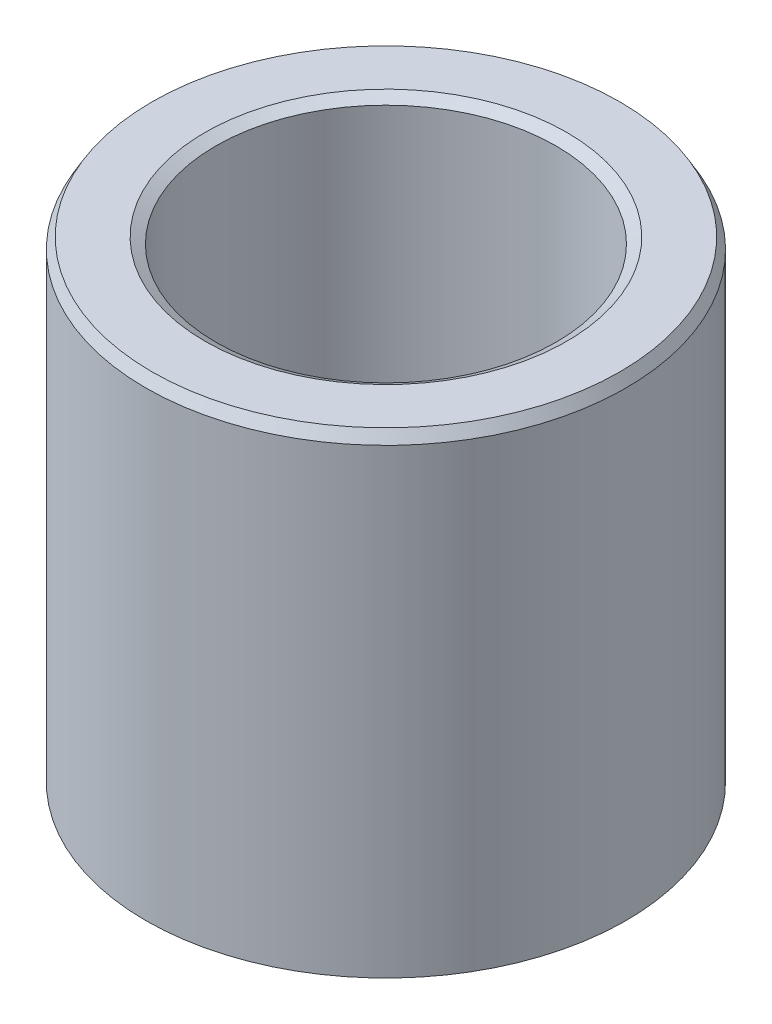
ISO-10303-21;
HEADER;
FILE_DESCRIPTION(('STEP AP214'),'2;1');
FILE_NAME('part.step','',(''),(''),'','','');
FILE_SCHEMA(('AUTOMOTIVE_DESIGN { 1 0 10303 214 1 1 1 1 }'));
ENDSEC;
DATA;
#1=APPLICATION_CONTEXT('core data for automotive mechanical design processes');
#2=APPLICATION_PROTOCOL_DEFINITION('international standard','automotive_design',2000,#1);
#3=PRODUCT_CONTEXT('',#1,'mechanical');
#4=PRODUCT('Part','Part','',(#3));
#5=PRODUCT_RELATED_PRODUCT_CATEGORY('part','',(#4));
#6=PRODUCT_DEFINITION_FORMATION('','',#4);
#7=PRODUCT_DEFINITION_CONTEXT('part definition',#1,'design');
#8=PRODUCT_DEFINITION('design','',#6,#7);
#9=PRODUCT_DEFINITION_SHAPE('','',#8);
#10=(LENGTH_UNIT() NAMED_UNIT(*) SI_UNIT(.MILLI.,.METRE.));
#11=(NAMED_UNIT(*) PLANE_ANGLE_UNIT() SI_UNIT($,.RADIAN.));
#12=(NAMED_UNIT(*) SI_UNIT($,.STERADIAN.) SOLID_ANGLE_UNIT());
#13=UNCERTAINTY_MEASURE_WITH_UNIT(LENGTH_MEASURE(1.E-05),#10,'distance_accuracy_value','');
#14=(GEOMETRIC_REPRESENTATION_CONTEXT(3) GLOBAL_UNCERTAINTY_ASSIGNED_CONTEXT((#13)) GLOBAL_UNIT_ASSIGNED_CONTEXT((#10,
#11,#12)) REPRESENTATION_CONTEXT('',''));
#15=CARTESIAN_POINT('',(0.,0.,0.));
#16=DIRECTION('',(0.,0.,1.));
#17=DIRECTION('',(1.,0.,0.));
#18=AXIS2_PLACEMENT_3D('',#15,#16,#17);
#19=CARTESIAN_POINT('',(0.,54.7817527203341,0.));
#20=DIRECTION('',(0.,-1.,0.));
#21=DIRECTION('',(0.,0.,-1.));
#22=AXIS2_PLACEMENT_3D('',#19,#20,#21);
#23=CYLINDRICAL_SURFACE('',#22,27.5);
#24=CARTESIAN_POINT('',(0.,0.715190612894365,0.));
#25=DIRECTION('',(0.,1.,0.));
#26=DIRECTION('',(0.,0.,1.));
#27=AXIS2_PLACEMENT_3D('',#24,#25,#26);
#28=CIRCLE('',#27,27.5);
#29=CARTESIAN_POINT('',(0.,0.715190612894365,27.5));
#30=VERTEX_POINT('',#29);
#31=EDGE_CURVE('E10',#30,#30,#28,.T.);
#32=ORIENTED_EDGE('',*,*,#31,.T.);
#33=EDGE_LOOP('',(#32));
#34=FACE_BOUND('',#33,.T.);
#35=CARTESIAN_POINT('',(0.,53.5430062417047,0.));
#36=DIRECTION('',(0.,1.,0.));
#37=DIRECTION('',(0.,0.,1.));
#38=AXIS2_PLACEMENT_3D('',#35,#36,#37);
#39=CIRCLE('',#38,27.5);
#40=CARTESIAN_POINT('',(0.,53.5430062417047,27.5));
#41=VERTEX_POINT('',#40);
#42=EDGE_CURVE('E50',#41,#41,#39,.F.);
#43=ORIENTED_EDGE('',*,*,#42,.T.);
#44=EDGE_LOOP('',(#43));
#45=FACE_BOUND('',#44,.T.);
#46=ADVANCED_FACE('F39',(#34,#45),#23,.T.);
#47=CARTESIAN_POINT('',(0.,54.7817527203341,0.));
#48=DIRECTION('',(0.,1.,0.));
#49=DIRECTION('',(0.,0.,1.));
#50=AXIS2_PLACEMENT_3D('',#47,#48,#49);
#51=PLANE('',#50);
#52=CARTESIAN_POINT('',(0.,54.7817527203341,0.));
#53=DIRECTION('',(0.,1.,0.));
#54=DIRECTION('',(0.,0.,1.));
#55=AXIS2_PLACEMENT_3D('',#52,#53,#54);
#56=CIRCLE('',#55,20.7174932138339);
#57=CARTESIAN_POINT('',(0.,54.7817527203341,20.7174932138339));
#58=VERTEX_POINT('',#57);
#59=EDGE_CURVE('E58',#58,#58,#56,.F.);
#60=ORIENTED_EDGE('',*,*,#59,.T.);
#61=EDGE_LOOP('',(#60));
#62=FACE_BOUND('',#61,.T.);
#63=CARTESIAN_POINT('',(0.,54.7817527203341,0.));
#64=DIRECTION('',(0.,1.,0.));
#65=DIRECTION('',(0.,0.,1.));
#66=AXIS2_PLACEMENT_3D('',#63,#64,#65);
#67=CIRCLE('',#66,26.7848093871057);
#68=CARTESIAN_POINT('',(0.,54.7817527203341,26.7848093871057));
#69=VERTEX_POINT('',#68);
#70=EDGE_CURVE('E61',#69,#69,#67,.T.);
#71=ORIENTED_EDGE('',*,*,#70,.T.);
#72=EDGE_LOOP('',(#71));
#73=FACE_BOUND('',#72,.T.);
#74=ADVANCED_FACE('F88',(#62,#73),#51,.T.);
#75=CARTESIAN_POINT('',(0.,0.,0.));
#76=DIRECTION('',(0.,1.,0.));
#77=DIRECTION('',(0.,0.,1.));
#78=AXIS2_PLACEMENT_3D('',#75,#76,#77);
#79=PLANE('',#78);
#80=CARTESIAN_POINT('',(0.,0.,0.));
#81=DIRECTION('',(0.,1.,0.));
#82=DIRECTION('',(0.,0.,1.));
#83=AXIS2_PLACEMENT_3D('',#80,#81,#82);
#84=CIRCLE('',#83,20.1939373480989);
#85=CARTESIAN_POINT('',(0.,0.,20.1939373480989));
#86=VERTEX_POINT('',#85);
#87=EDGE_CURVE('E51',#86,#86,#84,.T.);
#88=ORIENTED_EDGE('',*,*,#87,.T.);
#89=EDGE_LOOP('',(#88));
#90=FACE_BOUND('',#89,.T.);
#91=CARTESIAN_POINT('',(0.,0.,0.));
#92=DIRECTION('',(0.,1.,0.));
#93=DIRECTION('',(0.,0.,1.));
#94=AXIS2_PLACEMENT_3D('',#91,#92,#93);
#95=CIRCLE('',#94,26.2612535213706);
#96=CARTESIAN_POINT('',(0.,0.,26.2612535213706));
#97=VERTEX_POINT('',#96);
#98=EDGE_CURVE('E54',#97,#97,#95,.F.);
#99=ORIENTED_EDGE('',*,*,#98,.T.);
#100=EDGE_LOOP('',(#99));
#101=FACE_BOUND('',#100,.T.);
#102=ADVANCED_FACE('F83',(#90,#101),#79,.F.);
#103=CARTESIAN_POINT('',(0.,54.7817527203341,0.));
#104=DIRECTION('',(0.,-1.,0.));
#105=DIRECTION('',(0.,0.,-1.));
#106=AXIS2_PLACEMENT_3D('',#103,#104,#105);
#107=CYLINDRICAL_SURFACE('',#106,19.4787467352045);
#108=CARTESIAN_POINT('',(0.,54.0665621074397,0.));
#109=DIRECTION('',(0.,1.,0.));
#110=DIRECTION('',(0.,0.,1.));
#111=AXIS2_PLACEMENT_3D('',#108,#109,#110);
#112=CIRCLE('',#111,19.4787467352045);
#113=CARTESIAN_POINT('',(0.,54.0665621074397,19.4787467352045));
#114=VERTEX_POINT('',#113);
#115=EDGE_CURVE('E67',#114,#114,#112,.T.);
#116=ORIENTED_EDGE('',*,*,#115,.T.);
#117=EDGE_LOOP('',(#116));
#118=FACE_BOUND('',#117,.T.);
#119=CARTESIAN_POINT('',(0.,1.23874647862936,0.));
#120=DIRECTION('',(0.,1.,0.));
#121=DIRECTION('',(0.,0.,1.));
#122=AXIS2_PLACEMENT_3D('',#119,#120,#121);
#123=CIRCLE('',#122,19.4787467352045);
#124=CARTESIAN_POINT('',(0.,1.23874647862936,19.4787467352045));
#125=VERTEX_POINT('',#124);
#126=EDGE_CURVE('E69',#125,#125,#123,.F.);
#127=ORIENTED_EDGE('',*,*,#126,.T.);
#128=EDGE_LOOP('',(#127));
#129=FACE_BOUND('',#128,.T.);
#130=ADVANCED_FACE('F71',(#118,#129),#107,.F.);
#131=CARTESIAN_POINT('',(0.,54.0665621074397,0.));
#132=DIRECTION('',(0.,1.,0.));
#133=DIRECTION('',(0.,0.,1.));
#134=AXIS2_PLACEMENT_3D('',#131,#132,#133);
#135=CONICAL_SURFACE('',#134,19.4787467352045,1.0471975511966);
#136=CARTESIAN_POINT('',(0.,54.7817527203341,20.7174932138339));
#137=CARTESIAN_POINT('',(0.,54.7743028181164,20.7045896046815));
#138=CARTESIAN_POINT('',(0.,54.7668529158988,20.6916859955292));
#139=CARTESIAN_POINT('',(0.,54.7519531114635,20.6658787772244));
#140=CARTESIAN_POINT('',(0.,54.7445032092458,20.652975168072));
#141=CARTESIAN_POINT('',(0.,54.7296034048105,20.6271679497672));
#142=CARTESIAN_POINT('',(0.,54.7221535025929,20.6142643406148));
#143=CARTESIAN_POINT('',(0.,54.7072536981576,20.58845712231));
#144=CARTESIAN_POINT('',(0.,54.6998037959399,20.5755535131577));
#145=CARTESIAN_POINT('',(0.,54.6849039915046,20.5497462948529));
#146=CARTESIAN_POINT('',(0.,54.677454089287,20.5368426857005));
#147=CARTESIAN_POINT('',(0.,54.6625542848517,20.5110354673957));
#148=CARTESIAN_POINT('',(0.,54.655104382634,20.4981318582433));
#149=CARTESIAN_POINT('',(0.,54.6402045781987,20.4723246399385));
#150=CARTESIAN_POINT('',(0.,54.6327546759811,20.4594210307861));
#151=CARTESIAN_POINT('',(0.,54.6178548715458,20.4336138124814));
#152=CARTESIAN_POINT('',(0.,54.6104049693281,20.420710203329));
#153=CARTESIAN_POINT('',(0.,54.5955051648928,20.3949029850242));
#154=CARTESIAN_POINT('',(0.,54.5880552626752,20.3819993758718));
#155=CARTESIAN_POINT('',(0.,54.5731554582399,20.356192157567));
#156=CARTESIAN_POINT('',(0.,54.5657055560222,20.3432885484146));
#157=CARTESIAN_POINT('',(0.,54.5508057515869,20.3174813301099));
#158=CARTESIAN_POINT('',(0.,54.5433558493693,20.3045777209575));
#159=CARTESIAN_POINT('',(0.,54.528456044934,20.2787705026527));
#160=CARTESIAN_POINT('',(0.,54.5210061427163,20.2658668935003));
#161=CARTESIAN_POINT('',(0.,54.506106338281,20.2400596751955));
#162=CARTESIAN_POINT('',(0.,54.4986564360634,20.2271560660431));
#163=CARTESIAN_POINT('',(0.,54.4837566316281,20.2013488477384));
#164=CARTESIAN_POINT('',(0.,54.4763067294104,20.188445238586));
#165=CARTESIAN_POINT('',(0.,54.4614069249751,20.1626380202812));
#166=CARTESIAN_POINT('',(0.,54.4539570227575,20.1497344111288));
#167=CARTESIAN_POINT('',(0.,54.4390572183222,20.123927192824));
#168=CARTESIAN_POINT('',(0.,54.4316073161045,20.1110235836716));
#169=CARTESIAN_POINT('',(0.,54.4167075116692,20.0852163653668));
#170=CARTESIAN_POINT('',(0.,54.4092576094516,20.0723127562145));
#171=CARTESIAN_POINT('',(0.,54.3943578050163,20.0465055379097));
#172=CARTESIAN_POINT('',(0.,54.3869079027986,20.0336019287573));
#173=CARTESIAN_POINT('',(0.,54.3720080983633,20.0077947104525));
#174=CARTESIAN_POINT('',(0.,54.3645581961457,19.9948911013001));
#175=CARTESIAN_POINT('',(0.,54.3496583917104,19.9690838829953));
#176=CARTESIAN_POINT('',(0.,54.3422084894927,19.956180273843));
#177=CARTESIAN_POINT('',(0.,54.3273086850574,19.9303730555382));
#178=CARTESIAN_POINT('',(0.,54.3198587828398,19.9174694463858));
#179=CARTESIAN_POINT('',(0.,54.3049589784045,19.891662228081));
#180=CARTESIAN_POINT('',(0.,54.2975090761868,19.8787586189286));
#181=CARTESIAN_POINT('',(0.,54.2826092717515,19.8529514006238));
#182=CARTESIAN_POINT('',(0.,54.2751593695339,19.8400477914714));
#183=CARTESIAN_POINT('',(0.,54.2602595650986,19.8142405731667));
#184=CARTESIAN_POINT('',(0.,54.2528096628809,19.8013369640143));
#185=CARTESIAN_POINT('',(0.,54.2379098584456,19.7755297457095));
#186=CARTESIAN_POINT('',(0.,54.230459956228,19.7626261365571));
#187=CARTESIAN_POINT('',(0.,54.2155601517927,19.7368189182523));
#188=CARTESIAN_POINT('',(0.,54.208110249575,19.7239153090999));
#189=CARTESIAN_POINT('',(0.,54.1932104451397,19.6981080907952));
#190=CARTESIAN_POINT('',(0.,54.1857605429221,19.6852044816428));
#191=CARTESIAN_POINT('',(0.,54.1708607384868,19.659397263338));
#192=CARTESIAN_POINT('',(0.,54.1634108362691,19.6464936541856));
#193=CARTESIAN_POINT('',(0.,54.1485110318338,19.6206864358808));
#194=CARTESIAN_POINT('',(0.,54.1410611296162,19.6077828267284));
#195=CARTESIAN_POINT('',(0.,54.1261613251809,19.5819756084237));
#196=CARTESIAN_POINT('',(0.,54.1187114229632,19.5690719992713));
#197=CARTESIAN_POINT('',(0.,54.1038116185279,19.5432647809665));
#198=CARTESIAN_POINT('',(0.,54.0963617163103,19.5303611718141));
#199=CARTESIAN_POINT('',(0.,54.081461911875,19.5045539535093));
#200=CARTESIAN_POINT('',(0.,54.0740120096573,19.4916503443569));
#201=CARTESIAN_POINT('',(0.,54.0665621074397,19.4787467352045));
#202=B_SPLINE_CURVE_WITH_KNOTS('',3,(#136,#137,#138,#139,#140,#141,#142,#143,#144,#145,#146,
#147,#148,#149,#150,#151,#152,#153,#154,#155,#156,#157,#158,#159,#160,#161,#162,#163,#164,#165,
#166,#167,#168,#169,#170,#171,#172,#173,#174,#175,#176,#177,#178,#179,#180,#181,#182,#183,#184,
#185,#186,#187,#188,#189,#190,#191,#192,#193,#194,#195,#196,#197,#198,#199,#200,#201),
.UNSPECIFIED.,.F.,.F.,(4,2,2,2,2,2,2,2,2,2,2,2,2,2,2,2,2,2,2,2,2,2,2,2,2,2,2,2,2,2,2,2,4),(0.,
0.0446994133058967,0.0893988266117964,0.134098239917696,0.178797653223593,0.223497066529492,
0.268196479835392,0.312895893141292,0.357595306447189,0.402294719753088,0.446994133058988,
0.491693546364888,0.536392959670784,0.581092372976684,0.625791786282584,0.670491199588481,
0.71519061289438,0.75989002620028,0.80458943950618,0.849288852812077,0.893988266117976,
0.938687679423876,0.983387092729776,1.02808650603567,1.07278591934157,1.11748533264747,
1.16218474595337,1.20688415925927,1.25158357256517,1.29628298587107,1.34098239917696,
1.38568181248286,1.43038122578876),.UNSPECIFIED.);
#203=EDGE_CURVE('BSEAM77',#58,#114,#202,.T.);
#204=ORIENTED_EDGE('',*,*,#59,.F.);
#205=ORIENTED_EDGE('',*,*,#115,.F.);
#206=ORIENTED_EDGE('',*,*,#203,.T.);
#207=ORIENTED_EDGE('',*,*,#203,.F.);
#208=EDGE_LOOP('',(#204,#206,#205,#207));
#209=FACE_BOUND('',#208,.T.);
#210=ADVANCED_FACE('F77',(#209),#135,.F.);
#211=CARTESIAN_POINT('',(0.,0.,0.));
#212=DIRECTION('',(0.,-1.,0.));
#213=DIRECTION('',(0.,0.,-1.));
#214=AXIS2_PLACEMENT_3D('',#211,#212,#213);
#215=CONICAL_SURFACE('',#214,20.1939373480989,0.523598775598295);
#216=ORIENTED_EDGE('',*,*,#126,.F.);
#217=EDGE_LOOP('',(#216));
#218=FACE_BOUND('',#217,.T.);
#219=ORIENTED_EDGE('',*,*,#87,.F.);
#220=EDGE_LOOP('',(#219));
#221=FACE_BOUND('',#220,.T.);
#222=ADVANCED_FACE('F73',(#218,#221),#215,.F.);
#223=CARTESIAN_POINT('',(0.,0.715190612894365,0.));
#224=DIRECTION('',(0.,1.,0.));
#225=DIRECTION('',(0.,0.,1.));
#226=AXIS2_PLACEMENT_3D('',#223,#224,#225);
#227=CONICAL_SURFACE('',#226,27.5,1.0471975511966);
#228=ORIENTED_EDGE('',*,*,#98,.F.);
#229=EDGE_LOOP('',(#228));
#230=FACE_BOUND('',#229,.T.);
#231=ORIENTED_EDGE('',*,*,#31,.F.);
#232=EDGE_LOOP('',(#231));
#233=FACE_BOUND('',#232,.T.);
#234=ADVANCED_FACE('F76',(#230,#233),#227,.T.);
#235=CARTESIAN_POINT('',(0.,54.7817527203341,0.));
#236=DIRECTION('',(0.,-1.,0.));
#237=DIRECTION('',(0.,0.,-1.));
#238=AXIS2_PLACEMENT_3D('',#235,#236,#237);
#239=CONICAL_SURFACE('',#238,26.7848093871057,0.523598775598293);
#240=ORIENTED_EDGE('',*,*,#42,.F.);
#241=EDGE_LOOP('',(#240));
#242=FACE_BOUND('',#241,.T.);
#243=ORIENTED_EDGE('',*,*,#70,.F.);
#244=EDGE_LOOP('',(#243));
#245=FACE_BOUND('',#244,.T.);
#246=ADVANCED_FACE('F45',(#242,#245),#239,.T.);
#247=CLOSED_SHELL('',(#46,#74,#102,#130,#210,#222,#234,#246));
#248=MANIFOLD_SOLID_BREP('B2',#247);
#249=ADVANCED_BREP_SHAPE_REPRESENTATION('',(#18,#248),#14);
#250=SHAPE_DEFINITION_REPRESENTATION(#9,#249);
ENDSEC;
END-ISO-10303-21;
